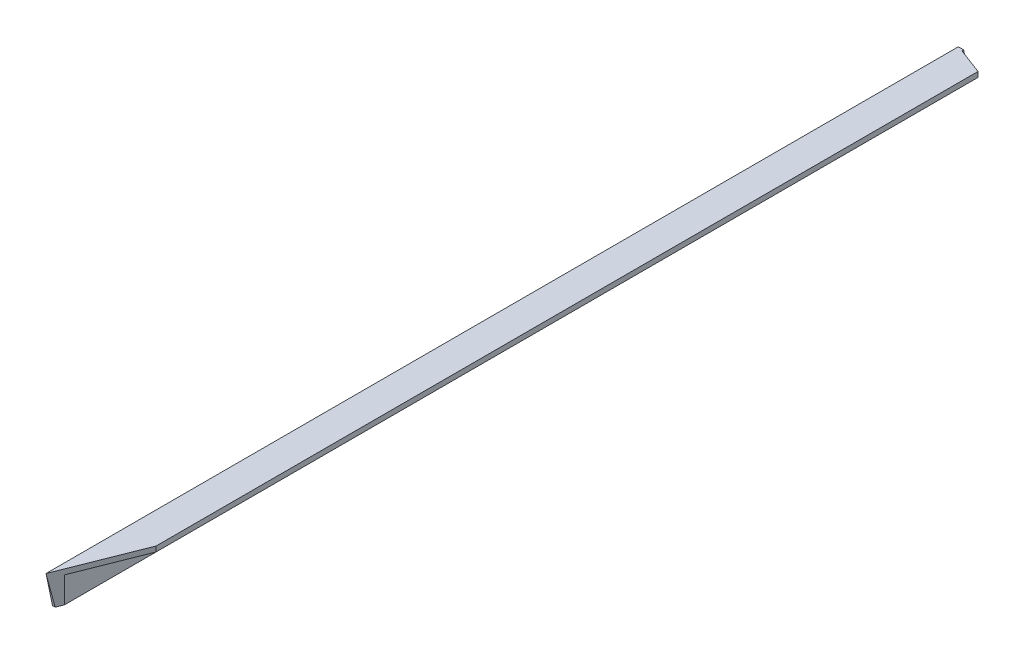
ISO-10303-21;
HEADER;
FILE_DESCRIPTION(('STEP AP214'),'2;1');
FILE_NAME('part.step','',(''),(''),'','','');
FILE_SCHEMA(('AUTOMOTIVE_DESIGN { 1 0 10303 214 1 1 1 1 }'));
ENDSEC;
DATA;
#1=APPLICATION_CONTEXT('core data for automotive mechanical design processes');
#2=APPLICATION_PROTOCOL_DEFINITION('international standard','automotive_design',2000,#1);
#3=PRODUCT_CONTEXT('',#1,'mechanical');
#4=PRODUCT('Part','Part','',(#3));
#5=PRODUCT_RELATED_PRODUCT_CATEGORY('part','',(#4));
#6=PRODUCT_DEFINITION_FORMATION('','',#4);
#7=PRODUCT_DEFINITION_CONTEXT('part definition',#1,'design');
#8=PRODUCT_DEFINITION('design','',#6,#7);
#9=PRODUCT_DEFINITION_SHAPE('','',#8);
#10=(LENGTH_UNIT() NAMED_UNIT(*) SI_UNIT(.MILLI.,.METRE.));
#11=(NAMED_UNIT(*) PLANE_ANGLE_UNIT() SI_UNIT($,.RADIAN.));
#12=(NAMED_UNIT(*) SI_UNIT($,.STERADIAN.) SOLID_ANGLE_UNIT());
#13=UNCERTAINTY_MEASURE_WITH_UNIT(LENGTH_MEASURE(1.E-05),#10,'distance_accuracy_value','');
#14=(GEOMETRIC_REPRESENTATION_CONTEXT(3) GLOBAL_UNCERTAINTY_ASSIGNED_CONTEXT((#13)) GLOBAL_UNIT_ASSIGNED_CONTEXT((#10,
#11,#12)) REPRESENTATION_CONTEXT('',''));
#15=CARTESIAN_POINT('',(0.,0.,0.));
#16=DIRECTION('',(0.,0.,1.));
#17=DIRECTION('',(1.,0.,0.));
#18=AXIS2_PLACEMENT_3D('',#15,#16,#17);
#19=CARTESIAN_POINT('',(38.1,0.,1143.));
#20=DIRECTION('',(0.,-1.,0.));
#21=DIRECTION('',(0.,0.,-1.));
#22=AXIS2_PLACEMENT_3D('',#19,#20,#21);
#23=PLANE('',#22);
#24=DIRECTION('',(0.,0.,1.));
#25=VECTOR('',#24,1.);
#26=CARTESIAN_POINT('',(6.35,0.,0.));
#27=LINE('',#26,#25);
#28=CARTESIAN_POINT('',(6.35,0.,29.6655264476905));
#29=VERTEX_POINT('',#28);
#30=CARTESIAN_POINT('',(6.35000000000001,0.,31.75));
#31=VERTEX_POINT('',#30);
#32=EDGE_CURVE('E138',#29,#31,#27,.T.);
#33=ORIENTED_EDGE('',*,*,#32,.F.);
#34=DIRECTION('',(-1.,0.,0.));
#35=VECTOR('',#34,1.);
#36=CARTESIAN_POINT('',(38.1,0.,29.6655264476905));
#37=LINE('',#36,#35);
#38=CARTESIAN_POINT('',(0.,0.,29.6655264476905));
#39=VERTEX_POINT('',#38);
#40=EDGE_CURVE('E102',#29,#39,#37,.T.);
#41=ORIENTED_EDGE('',*,*,#40,.T.);
#42=DIRECTION('',(0.,0.,-1.));
#43=VECTOR('',#42,1.);
#44=CARTESIAN_POINT('',(0.,0.,1143.));
#45=LINE('',#44,#43);
#46=CARTESIAN_POINT('',(0.,0.,1143.));
#47=VERTEX_POINT('',#46);
#48=EDGE_CURVE('E39',#47,#39,#45,.T.);
#49=ORIENTED_EDGE('',*,*,#48,.F.);
#50=DIRECTION('',(0.368131153612089,0.,-0.929773872369101));
#51=VECTOR('',#50,1.);
#52=CARTESIAN_POINT('',(391.224586371023,0.,154.899984374914));
#53=LINE('',#52,#51);
#54=CARTESIAN_POINT('',(38.1,0.,1046.7723806049));
#55=VERTEX_POINT('',#54);
#56=EDGE_CURVE('E105',#47,#55,#53,.T.);
#57=ORIENTED_EDGE('',*,*,#56,.T.);
#58=DIRECTION('',(0.,0.,-1.));
#59=VECTOR('',#58,1.);
#60=CARTESIAN_POINT('',(38.1,0.,1143.));
#61=LINE('',#60,#59);
#62=CARTESIAN_POINT('',(38.1,0.,43.7909820623289));
#63=VERTEX_POINT('',#62);
#64=EDGE_CURVE('E128',#55,#63,#61,.T.);
#65=ORIENTED_EDGE('',*,*,#64,.T.);
#66=DIRECTION('',(0.935018240996946,0.,0.354599617883292));
#67=VECTOR('',#66,1.);
#68=CARTESIAN_POINT('',(-9.72848362817384,0.,25.6523391194869));
#69=LINE('',#68,#67);
#70=EDGE_CURVE('E144',#31,#63,#69,.T.);
#71=ORIENTED_EDGE('',*,*,#70,.F.);
#72=EDGE_LOOP('',(#33,#41,#49,#57,#65,#71));
#73=FACE_BOUND('',#72,.T.);
#74=ADVANCED_FACE('F32',(#73),#23,.F.);
#75=CARTESIAN_POINT('',(0.,-38.1,1143.));
#76=DIRECTION('',(0.,1.,0.));
#77=DIRECTION('',(0.,0.,1.));
#78=AXIS2_PLACEMENT_3D('',#75,#76,#77);
#79=PLANE('',#78);
#80=DIRECTION('',(0.368131153612089,0.,-0.929773872369101));
#81=VECTOR('',#80,1.);
#82=CARTESIAN_POINT('',(391.224586371023,-38.1,154.899984374914));
#83=LINE('',#82,#81);
#84=CARTESIAN_POINT('',(3.16485855985375,-38.1,1135.00664553971));
#85=VERTEX_POINT('',#84);
#86=CARTESIAN_POINT('',(6.34999999999999,-38.1,1126.96206343415));
#87=VERTEX_POINT('',#86);
#88=EDGE_CURVE('E112',#85,#87,#83,.T.);
#89=ORIENTED_EDGE('',*,*,#88,.F.);
#90=DIRECTION('',(-1.,0.,0.));
#91=VECTOR('',#90,1.);
#92=CARTESIAN_POINT('',(38.1,-38.1,1135.00664553971));
#93=LINE('',#92,#91);
#94=CARTESIAN_POINT('',(0.,-38.1,1135.00664553971));
#95=VERTEX_POINT('',#94);
#96=EDGE_CURVE('E53',#85,#95,#93,.T.);
#97=ORIENTED_EDGE('',*,*,#96,.T.);
#98=DIRECTION('',(0.,0.,-1.));
#99=VECTOR('',#98,1.);
#100=CARTESIAN_POINT('',(0.,-38.1,1143.));
#101=LINE('',#100,#99);
#102=CARTESIAN_POINT('',(0.,-38.1,21.6721719874037));
#103=VERTEX_POINT('',#102);
#104=EDGE_CURVE('E101',#95,#103,#101,.T.);
#105=ORIENTED_EDGE('',*,*,#104,.T.);
#106=DIRECTION('',(-1.,0.,0.));
#107=VECTOR('',#106,1.);
#108=CARTESIAN_POINT('',(38.1,-38.1,21.6721719874039));
#109=LINE('',#108,#107);
#110=CARTESIAN_POINT('',(6.35,-38.1,21.6721719874039));
#111=VERTEX_POINT('',#110);
#112=EDGE_CURVE('E46',#111,#103,#109,.T.);
#113=ORIENTED_EDGE('',*,*,#112,.F.);
#114=DIRECTION('',(0.,0.,-1.));
#115=VECTOR('',#114,1.);
#116=CARTESIAN_POINT('',(6.35,-38.1,1143.));
#117=LINE('',#116,#115);
#118=EDGE_CURVE('E117',#87,#111,#117,.T.);
#119=ORIENTED_EDGE('',*,*,#118,.F.);
#120=EDGE_LOOP('',(#89,#97,#105,#113,#119));
#121=FACE_BOUND('',#120,.T.);
#122=ADVANCED_FACE('F156',(#121),#79,.F.);
#123=CARTESIAN_POINT('',(6.35,-38.1,1143.));
#124=DIRECTION('',(-1.,0.,0.));
#125=DIRECTION('',(0.,0.,1.));
#126=AXIS2_PLACEMENT_3D('',#123,#124,#125);
#127=PLANE('',#126);
#128=ORIENTED_EDGE('',*,*,#118,.T.);
#129=DIRECTION('',(0.,0.97869297941211,0.205329131029787));
#130=VECTOR('',#129,1.);
#131=CARTESIAN_POINT('',(6.35,187.235513076694,68.9474115809088));
#132=LINE('',#131,#130);
#133=EDGE_CURVE('E113',#111,#29,#132,.T.);
#134=ORIENTED_EDGE('',*,*,#133,.T.);
#135=ORIENTED_EDGE('',*,*,#32,.T.);
#136=DIRECTION('',(0.,1.,0.));
#137=VECTOR('',#136,1.);
#138=CARTESIAN_POINT('',(6.35000000000001,-38.1,31.75));
#139=LINE('',#138,#137);
#140=CARTESIAN_POINT('',(6.35000000000001,-6.35000000000002,31.75));
#141=VERTEX_POINT('',#140);
#142=EDGE_CURVE('E141',#141,#31,#139,.T.);
#143=ORIENTED_EDGE('',*,*,#142,.F.);
#144=DIRECTION('',(0.,0.,-1.));
#145=VECTOR('',#144,1.);
#146=CARTESIAN_POINT('',(6.35,-6.35,1143.));
#147=LINE('',#146,#145);
#148=CARTESIAN_POINT('',(6.35,-6.35,1126.96206343415));
#149=VERTEX_POINT('',#148);
#150=EDGE_CURVE('E122',#149,#141,#147,.T.);
#151=ORIENTED_EDGE('',*,*,#150,.F.);
#152=DIRECTION('',(0.,1.,0.));
#153=VECTOR('',#152,1.);
#154=CARTESIAN_POINT('',(6.35,-38.1,1126.96206343415));
#155=LINE('',#154,#153);
#156=EDGE_CURVE('E133',#87,#149,#155,.T.);
#157=ORIENTED_EDGE('',*,*,#156,.F.);
#158=EDGE_LOOP('',(#128,#134,#135,#143,#151,#157));
#159=FACE_BOUND('',#158,.T.);
#160=ADVANCED_FACE('F162',(#159),#127,.F.);
#161=CARTESIAN_POINT('',(6.35,-6.35,1143.));
#162=DIRECTION('',(0.,1.,0.));
#163=DIRECTION('',(0.,0.,1.));
#164=AXIS2_PLACEMENT_3D('',#161,#162,#163);
#165=PLANE('',#164);
#166=ORIENTED_EDGE('',*,*,#150,.T.);
#167=DIRECTION('',(0.935018240996946,0.,0.354599617883292));
#168=VECTOR('',#167,1.);
#169=CARTESIAN_POINT('',(374.792839566996,-6.35,171.479562904558));
#170=LINE('',#169,#168);
#171=CARTESIAN_POINT('',(38.1,-6.35000000000002,43.7909820623289));
#172=VERTEX_POINT('',#171);
#173=EDGE_CURVE('E130',#141,#172,#170,.T.);
#174=ORIENTED_EDGE('',*,*,#173,.T.);
#175=DIRECTION('',(0.,0.,-1.));
#176=VECTOR('',#175,1.);
#177=CARTESIAN_POINT('',(38.1,-6.35,1143.));
#178=LINE('',#177,#176);
#179=CARTESIAN_POINT('',(38.1,-6.35000000000002,1046.7723806049));
#180=VERTEX_POINT('',#179);
#181=EDGE_CURVE('E125',#180,#172,#178,.T.);
#182=ORIENTED_EDGE('',*,*,#181,.F.);
#183=DIRECTION('',(0.368131153612089,0.,-0.929773872369101));
#184=VECTOR('',#183,1.);
#185=CARTESIAN_POINT('',(0.860555468749564,-6.35,1140.82653007572));
#186=LINE('',#185,#184);
#187=EDGE_CURVE('E135',#149,#180,#186,.T.);
#188=ORIENTED_EDGE('',*,*,#187,.F.);
#189=EDGE_LOOP('',(#166,#174,#182,#188));
#190=FACE_BOUND('',#189,.T.);
#191=ADVANCED_FACE('F165',(#190),#165,.F.);
#192=CARTESIAN_POINT('',(38.1,-6.35,1143.));
#193=DIRECTION('',(-1.,0.,0.));
#194=DIRECTION('',(0.,0.,1.));
#195=AXIS2_PLACEMENT_3D('',#192,#193,#194);
#196=PLANE('',#195);
#197=ORIENTED_EDGE('',*,*,#181,.T.);
#198=DIRECTION('',(0.,1.,0.));
#199=VECTOR('',#198,1.);
#200=CARTESIAN_POINT('',(38.1,-38.1,43.7909820623289));
#201=LINE('',#200,#199);
#202=EDGE_CURVE('E137',#172,#63,#201,.T.);
#203=ORIENTED_EDGE('',*,*,#202,.T.);
#204=ORIENTED_EDGE('',*,*,#64,.F.);
#205=DIRECTION('',(0.,1.,0.));
#206=VECTOR('',#205,1.);
#207=CARTESIAN_POINT('',(38.1,-38.1,1046.7723806049));
#208=LINE('',#207,#206);
#209=EDGE_CURVE('E108',#180,#55,#208,.T.);
#210=ORIENTED_EDGE('',*,*,#209,.F.);
#211=EDGE_LOOP('',(#197,#203,#204,#210));
#212=FACE_BOUND('',#211,.T.);
#213=ADVANCED_FACE('F168',(#212),#196,.F.);
#214=CARTESIAN_POINT('',(0.,0.,1143.));
#215=DIRECTION('',(1.,0.,0.));
#216=DIRECTION('',(0.,1.,0.));
#217=AXIS2_PLACEMENT_3D('',#214,#215,#216);
#218=PLANE('',#217);
#219=ORIENTED_EDGE('',*,*,#104,.F.);
#220=DIRECTION('',(0.,-0.97869297941211,-0.205329131029788));
#221=VECTOR('',#220,1.);
#222=CARTESIAN_POINT('',(0.,-229.690626605736,1094.81106050748));
#223=LINE('',#222,#221);
#224=EDGE_CURVE('E91',#47,#95,#223,.T.);
#225=ORIENTED_EDGE('',*,*,#224,.F.);
#226=ORIENTED_EDGE('',*,*,#48,.T.);
#227=DIRECTION('',(0.,0.97869297941211,0.205329131029787));
#228=VECTOR('',#227,1.);
#229=CARTESIAN_POINT('',(0.,-5.96141151212513,28.4148263085816));
#230=LINE('',#229,#228);
#231=EDGE_CURVE('E152',#103,#39,#230,.T.);
#232=ORIENTED_EDGE('',*,*,#231,.F.);
#233=EDGE_LOOP('',(#219,#225,#226,#232));
#234=FACE_BOUND('',#233,.T.);
#235=ADVANCED_FACE('F98',(#234),#218,.F.);
#236=CARTESIAN_POINT('',(-9.72848362817384,-38.1,25.6523391194869));
#237=DIRECTION('',(-0.354599617883292,0.,0.935018240996946));
#238=DIRECTION('',(0.935018240996946,0.,0.354599617883292));
#239=AXIS2_PLACEMENT_3D('',#236,#237,#238);
#240=PLANE('',#239);
#241=ORIENTED_EDGE('',*,*,#142,.T.);
#242=ORIENTED_EDGE('',*,*,#70,.T.);
#243=ORIENTED_EDGE('',*,*,#202,.F.);
#244=ORIENTED_EDGE('',*,*,#173,.F.);
#245=EDGE_LOOP('',(#241,#242,#243,#244));
#246=FACE_BOUND('',#245,.T.);
#247=ADVANCED_FACE('F171',(#246),#240,.F.);
#248=CARTESIAN_POINT('',(391.224586371023,-38.1,154.899984374914));
#249=DIRECTION('',(0.929773872369101,0.,0.368131153612089));
#250=DIRECTION('',(0.368131153612089,0.,-0.929773872369101));
#251=AXIS2_PLACEMENT_3D('',#248,#249,#250);
#252=PLANE('',#251);
#253=DIRECTION('',(-0.0810299081273527,0.975474714356555,0.204653941178444));
#254=VECTOR('',#253,1.);
#255=CARTESIAN_POINT('',(21.9659959980408,-264.43660331034,1087.52137788625));
#256=LINE('',#255,#254);
#257=EDGE_CURVE('E11',#85,#47,#256,.T.);
#258=ORIENTED_EDGE('',*,*,#257,.F.);
#259=ORIENTED_EDGE('',*,*,#88,.T.);
#260=ORIENTED_EDGE('',*,*,#156,.T.);
#261=ORIENTED_EDGE('',*,*,#187,.T.);
#262=ORIENTED_EDGE('',*,*,#209,.T.);
#263=ORIENTED_EDGE('',*,*,#56,.F.);
#264=EDGE_LOOP('',(#258,#259,#260,#261,#262,#263));
#265=FACE_BOUND('',#264,.T.);
#266=ADVANCED_FACE('F106',(#265),#252,.T.);
#267=CARTESIAN_POINT('',(38.1000000000001,-229.690626605736,1094.81106050748));
#268=DIRECTION('',(0.,0.205329131029788,-0.97869297941211));
#269=DIRECTION('',(0.,0.97869297941211,0.205329131029788));
#270=AXIS2_PLACEMENT_3D('',#267,#268,#269);
#271=PLANE('',#270);
#272=ORIENTED_EDGE('',*,*,#257,.T.);
#273=ORIENTED_EDGE('',*,*,#224,.T.);
#274=ORIENTED_EDGE('',*,*,#96,.F.);
#275=EDGE_LOOP('',(#272,#273,#274));
#276=FACE_BOUND('',#275,.T.);
#277=ADVANCED_FACE('F90',(#276),#271,.F.);
#278=CARTESIAN_POINT('',(38.1,-5.96141151212513,28.4148263085816));
#279=DIRECTION('',(0.,-0.205329131029787,0.97869297941211));
#280=DIRECTION('',(0.,-0.97869297941211,-0.205329131029787));
#281=AXIS2_PLACEMENT_3D('',#278,#279,#280);
#282=PLANE('',#281);
#283=ORIENTED_EDGE('',*,*,#112,.T.);
#284=ORIENTED_EDGE('',*,*,#231,.T.);
#285=ORIENTED_EDGE('',*,*,#40,.F.);
#286=ORIENTED_EDGE('',*,*,#133,.F.);
#287=EDGE_LOOP('',(#283,#284,#285,#286));
#288=FACE_BOUND('',#287,.T.);
#289=ADVANCED_FACE('F220',(#288),#282,.F.);
#290=CLOSED_SHELL('',(#74,#122,#160,#191,#213,#235,#247,#266,#277,#289));
#291=MANIFOLD_SOLID_BREP('B2',#290);
#292=ADVANCED_BREP_SHAPE_REPRESENTATION('',(#18,#291),#14);
#293=SHAPE_DEFINITION_REPRESENTATION(#9,#292);
ENDSEC;
END-ISO-10303-21;
